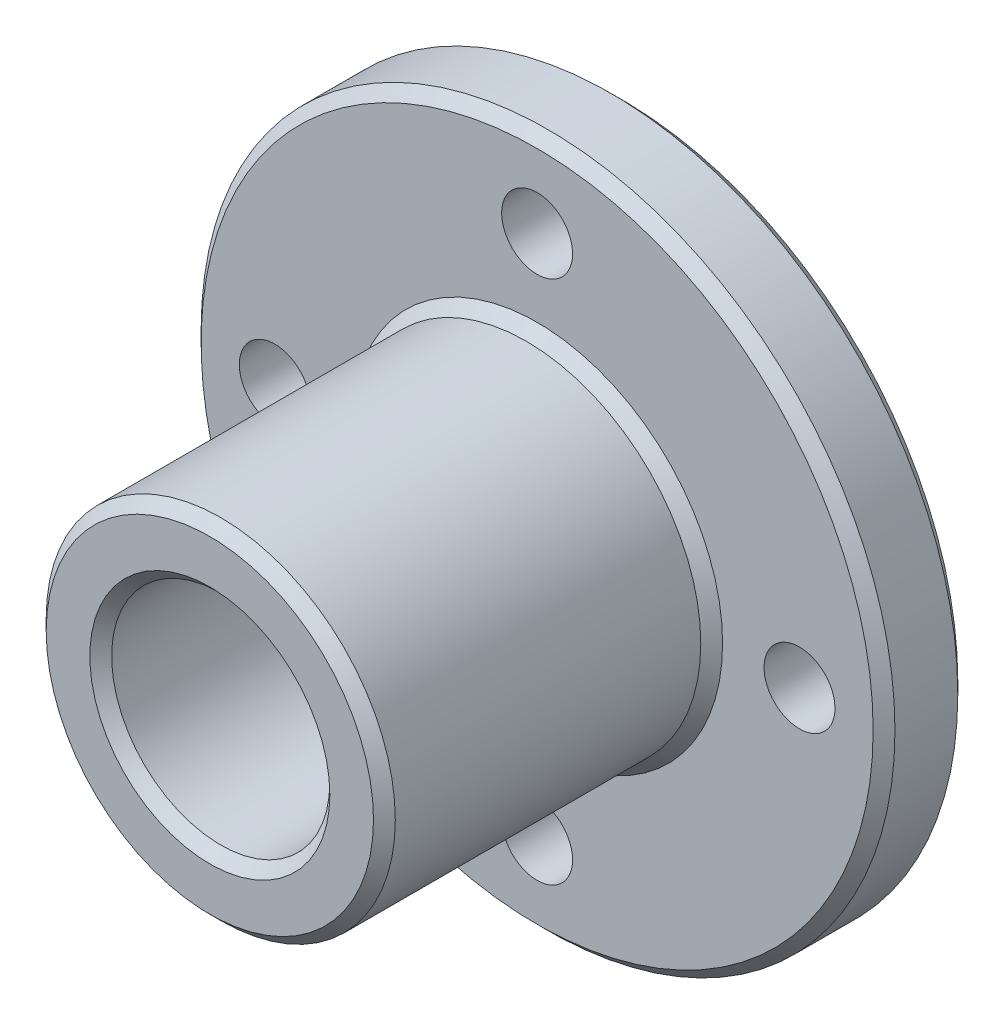
ISO-10303-21;
HEADER;
FILE_DESCRIPTION(('STEP AP214'),'2;1');
FILE_NAME('part.step','',(''),(''),'','','');
FILE_SCHEMA(('AUTOMOTIVE_DESIGN { 1 0 10303 214 1 1 1 1 }'));
ENDSEC;
DATA;
#1=APPLICATION_CONTEXT('core data for automotive mechanical design processes');
#2=APPLICATION_PROTOCOL_DEFINITION('international standard','automotive_design',2000,#1);
#3=PRODUCT_CONTEXT('',#1,'mechanical');
#4=PRODUCT('Part','Part','',(#3));
#5=PRODUCT_RELATED_PRODUCT_CATEGORY('part','',(#4));
#6=PRODUCT_DEFINITION_FORMATION('','',#4);
#7=PRODUCT_DEFINITION_CONTEXT('part definition',#1,'design');
#8=PRODUCT_DEFINITION('design','',#6,#7);
#9=PRODUCT_DEFINITION_SHAPE('','',#8);
#10=(LENGTH_UNIT() NAMED_UNIT(*) SI_UNIT(.MILLI.,.METRE.));
#11=(NAMED_UNIT(*) PLANE_ANGLE_UNIT() SI_UNIT($,.RADIAN.));
#12=(NAMED_UNIT(*) SI_UNIT($,.STERADIAN.) SOLID_ANGLE_UNIT());
#13=UNCERTAINTY_MEASURE_WITH_UNIT(LENGTH_MEASURE(1.E-05),#10,'distance_accuracy_value','');
#14=(GEOMETRIC_REPRESENTATION_CONTEXT(3) GLOBAL_UNCERTAINTY_ASSIGNED_CONTEXT((#13)) GLOBAL_UNIT_ASSIGNED_CONTEXT((#10,
#11,#12)) REPRESENTATION_CONTEXT('',''));
#15=CARTESIAN_POINT('',(0.,0.,0.));
#16=DIRECTION('',(0.,0.,1.));
#17=DIRECTION('',(1.,0.,0.));
#18=AXIS2_PLACEMENT_3D('',#15,#16,#17);
#19=CARTESIAN_POINT('',(0.,0.,3.88));
#20=DIRECTION('',(0.,0.,1.));
#21=DIRECTION('',(1.,0.,0.));
#22=AXIS2_PLACEMENT_3D('',#19,#20,#21);
#23=PLANE('',#22);
#24=CARTESIAN_POINT('',(0.,0.,3.88));
#25=DIRECTION('',(0.,0.,1.));
#26=DIRECTION('',(1.,0.,0.));
#27=AXIS2_PLACEMENT_3D('',#24,#25,#26);
#28=CIRCLE('',#27,15.4);
#29=CARTESIAN_POINT('',(15.4,0.,3.88));
#30=VERTEX_POINT('',#29);
#31=EDGE_CURVE('E53',#30,#30,#28,.T.);
#32=ORIENTED_EDGE('',*,*,#31,.T.);
#33=EDGE_LOOP('',(#32));
#34=FACE_BOUND('',#33,.T.);
#35=CARTESIAN_POINT('',(0.,0.,3.88));
#36=DIRECTION('',(0.,0.,1.));
#37=DIRECTION('',(1.,0.,0.));
#38=AXIS2_PLACEMENT_3D('',#35,#36,#37);
#39=CIRCLE('',#38,8.49999999999998);
#40=CARTESIAN_POINT('',(8.49999999999998,0.,3.88));
#41=VERTEX_POINT('',#40);
#42=EDGE_CURVE('E56',#41,#41,#39,.F.);
#43=ORIENTED_EDGE('',*,*,#42,.T.);
#44=EDGE_LOOP('',(#43));
#45=FACE_BOUND('',#44,.T.);
#46=CARTESIAN_POINT('',(-12.025,0.,3.88));
#47=DIRECTION('',(0.,0.,1.));
#48=DIRECTION('',(1.,0.,0.));
#49=AXIS2_PLACEMENT_3D('',#46,#47,#48);
#50=CIRCLE('',#49,1.625);
#51=CARTESIAN_POINT('',(-10.4,0.,3.88));
#52=VERTEX_POINT('',#51);
#53=EDGE_CURVE('E87',#52,#52,#50,.T.);
#54=ORIENTED_EDGE('',*,*,#53,.F.);
#55=EDGE_LOOP('',(#54));
#56=FACE_BOUND('',#55,.T.);
#57=CARTESIAN_POINT('',(12.025,0.,3.88));
#58=DIRECTION('',(0.,0.,1.));
#59=DIRECTION('',(1.,0.,0.));
#60=AXIS2_PLACEMENT_3D('',#57,#58,#59);
#61=CIRCLE('',#60,1.625);
#62=CARTESIAN_POINT('',(13.65,0.,3.88));
#63=VERTEX_POINT('',#62);
#64=EDGE_CURVE('E75',#63,#63,#61,.T.);
#65=ORIENTED_EDGE('',*,*,#64,.F.);
#66=EDGE_LOOP('',(#65));
#67=FACE_BOUND('',#66,.T.);
#68=CARTESIAN_POINT('',(0.,12.025,3.88));
#69=DIRECTION('',(0.,0.,1.));
#70=DIRECTION('',(1.,0.,0.));
#71=AXIS2_PLACEMENT_3D('',#68,#69,#70);
#72=CIRCLE('',#71,1.625);
#73=CARTESIAN_POINT('',(1.625,12.025,3.88));
#74=VERTEX_POINT('',#73);
#75=EDGE_CURVE('E71',#74,#74,#72,.T.);
#76=ORIENTED_EDGE('',*,*,#75,.F.);
#77=EDGE_LOOP('',(#76));
#78=FACE_BOUND('',#77,.T.);
#79=CARTESIAN_POINT('',(0.,-12.025,3.88));
#80=DIRECTION('',(0.,0.,1.));
#81=DIRECTION('',(1.,0.,0.));
#82=AXIS2_PLACEMENT_3D('',#79,#80,#81);
#83=CIRCLE('',#82,1.625);
#84=CARTESIAN_POINT('',(1.625,-12.025,3.88));
#85=VERTEX_POINT('',#84);
#86=EDGE_CURVE('E81',#85,#85,#83,.T.);
#87=ORIENTED_EDGE('',*,*,#86,.F.);
#88=EDGE_LOOP('',(#87));
#89=FACE_BOUND('',#88,.T.);
#90=ADVANCED_FACE('F30',(#34,#45,#56,#67,#78,#89),#23,.T.);
#91=CARTESIAN_POINT('',(0.,0.,0.));
#92=DIRECTION('',(0.,0.,1.));
#93=DIRECTION('',(1.,0.,0.));
#94=AXIS2_PLACEMENT_3D('',#91,#92,#93);
#95=PLANE('',#94);
#96=CARTESIAN_POINT('',(0.,0.,0.));
#97=DIRECTION('',(0.,0.,1.));
#98=DIRECTION('',(1.,0.,0.));
#99=AXIS2_PLACEMENT_3D('',#96,#97,#98);
#100=CIRCLE('',#99,15.4);
#101=CARTESIAN_POINT('',(15.4,0.,0.));
#102=VERTEX_POINT('',#101);
#103=EDGE_CURVE('E59',#102,#102,#100,.F.);
#104=ORIENTED_EDGE('',*,*,#103,.T.);
#105=EDGE_LOOP('',(#104));
#106=FACE_BOUND('',#105,.T.);
#107=CARTESIAN_POINT('',(0.,0.,0.));
#108=DIRECTION('',(0.,0.,1.));
#109=DIRECTION('',(1.,0.,0.));
#110=AXIS2_PLACEMENT_3D('',#107,#108,#109);
#111=CIRCLE('',#110,5.);
#112=CARTESIAN_POINT('',(5.,0.,0.));
#113=VERTEX_POINT('',#112);
#114=EDGE_CURVE('E68',#113,#113,#111,.T.);
#115=ORIENTED_EDGE('',*,*,#114,.T.);
#116=EDGE_LOOP('',(#115));
#117=FACE_BOUND('',#116,.T.);
#118=CARTESIAN_POINT('',(0.,12.025,0.));
#119=DIRECTION('',(0.,0.,1.));
#120=DIRECTION('',(1.,0.,0.));
#121=AXIS2_PLACEMENT_3D('',#118,#119,#120);
#122=CIRCLE('',#121,1.625);
#123=CARTESIAN_POINT('',(1.625,12.025,0.));
#124=VERTEX_POINT('',#123);
#125=EDGE_CURVE('E72',#124,#124,#122,.T.);
#126=ORIENTED_EDGE('',*,*,#125,.T.);
#127=EDGE_LOOP('',(#126));
#128=FACE_BOUND('',#127,.T.);
#129=CARTESIAN_POINT('',(12.025,0.,0.));
#130=DIRECTION('',(0.,0.,1.));
#131=DIRECTION('',(1.,0.,0.));
#132=AXIS2_PLACEMENT_3D('',#129,#130,#131);
#133=CIRCLE('',#132,1.625);
#134=CARTESIAN_POINT('',(13.65,0.,0.));
#135=VERTEX_POINT('',#134);
#136=EDGE_CURVE('E78',#135,#135,#133,.T.);
#137=ORIENTED_EDGE('',*,*,#136,.T.);
#138=EDGE_LOOP('',(#137));
#139=FACE_BOUND('',#138,.T.);
#140=CARTESIAN_POINT('',(0.,-12.025,0.));
#141=DIRECTION('',(0.,0.,1.));
#142=DIRECTION('',(1.,0.,0.));
#143=AXIS2_PLACEMENT_3D('',#140,#141,#142);
#144=CIRCLE('',#143,1.625);
#145=CARTESIAN_POINT('',(1.625,-12.025,0.));
#146=VERTEX_POINT('',#145);
#147=EDGE_CURVE('E84',#146,#146,#144,.T.);
#148=ORIENTED_EDGE('',*,*,#147,.T.);
#149=EDGE_LOOP('',(#148));
#150=FACE_BOUND('',#149,.T.);
#151=CARTESIAN_POINT('',(-12.025,0.,0.));
#152=DIRECTION('',(0.,0.,1.));
#153=DIRECTION('',(1.,0.,0.));
#154=AXIS2_PLACEMENT_3D('',#151,#152,#153);
#155=CIRCLE('',#154,1.625);
#156=CARTESIAN_POINT('',(-10.4,0.,0.));
#157=VERTEX_POINT('',#156);
#158=EDGE_CURVE('E90',#157,#157,#155,.T.);
#159=ORIENTED_EDGE('',*,*,#158,.T.);
#160=EDGE_LOOP('',(#159));
#161=FACE_BOUND('',#160,.T.);
#162=ADVANCED_FACE('F101',(#106,#117,#128,#139,#150,#161),#95,.F.);
#163=CARTESIAN_POINT('',(0.,0.,3.88));
#164=DIRECTION('',(0.,0.,-1.));
#165=DIRECTION('',(-1.,0.,0.));
#166=AXIS2_PLACEMENT_3D('',#163,#164,#165);
#167=CYLINDRICAL_SURFACE('',#166,15.9);
#168=CARTESIAN_POINT('',(0.,0.,0.5));
#169=DIRECTION('',(0.,0.,1.));
#170=DIRECTION('',(1.,0.,0.));
#171=AXIS2_PLACEMENT_3D('',#168,#169,#170);
#172=CIRCLE('',#171,15.9);
#173=CARTESIAN_POINT('',(15.9,0.,0.5));
#174=VERTEX_POINT('',#173);
#175=EDGE_CURVE('E62',#174,#174,#172,.T.);
#176=ORIENTED_EDGE('',*,*,#175,.T.);
#177=EDGE_LOOP('',(#176));
#178=FACE_BOUND('',#177,.T.);
#179=CARTESIAN_POINT('',(0.,0.,3.37999999999998));
#180=DIRECTION('',(0.,0.,1.));
#181=DIRECTION('',(1.,0.,0.));
#182=AXIS2_PLACEMENT_3D('',#179,#180,#181);
#183=CIRCLE('',#182,15.9);
#184=CARTESIAN_POINT('',(15.9,0.,3.37999999999998));
#185=VERTEX_POINT('',#184);
#186=EDGE_CURVE('E65',#185,#185,#183,.F.);
#187=ORIENTED_EDGE('',*,*,#186,.T.);
#188=EDGE_LOOP('',(#187));
#189=FACE_BOUND('',#188,.T.);
#190=ADVANCED_FACE('F119',(#178,#189),#167,.T.);
#191=CARTESIAN_POINT('',(0.,0.,3.88));
#192=DIRECTION('',(0.,0.,-1.));
#193=DIRECTION('',(-1.,0.,0.));
#194=AXIS2_PLACEMENT_3D('',#191,#192,#193);
#195=CYLINDRICAL_SURFACE('',#194,5.);
#196=CARTESIAN_POINT('',(0.,0.,18.38));
#197=DIRECTION('',(0.,0.,1.));
#198=DIRECTION('',(1.,0.,0.));
#199=AXIS2_PLACEMENT_3D('',#196,#197,#198);
#200=CIRCLE('',#199,5.);
#201=CARTESIAN_POINT('',(5.,0.,18.38));
#202=VERTEX_POINT('',#201);
#203=EDGE_CURVE('E10',#202,#202,#200,.T.);
#204=ORIENTED_EDGE('',*,*,#203,.T.);
#205=EDGE_LOOP('',(#204));
#206=FACE_BOUND('',#205,.T.);
#207=ORIENTED_EDGE('',*,*,#114,.F.);
#208=EDGE_LOOP('',(#207));
#209=FACE_BOUND('',#208,.T.);
#210=ADVANCED_FACE('F139',(#206,#209),#195,.F.);
#211=CARTESIAN_POINT('',(0.,12.025,3.88));
#212=DIRECTION('',(0.,0.,-1.));
#213=DIRECTION('',(-1.,0.,0.));
#214=AXIS2_PLACEMENT_3D('',#211,#212,#213);
#215=CYLINDRICAL_SURFACE('',#214,1.625);
#216=ORIENTED_EDGE('',*,*,#75,.T.);
#217=EDGE_LOOP('',(#216));
#218=FACE_BOUND('',#217,.T.);
#219=ORIENTED_EDGE('',*,*,#125,.F.);
#220=EDGE_LOOP('',(#219));
#221=FACE_BOUND('',#220,.T.);
#222=ADVANCED_FACE('F135',(#218,#221),#215,.F.);
#223=CARTESIAN_POINT('',(12.025,0.,3.88));
#224=DIRECTION('',(0.,0.,-1.));
#225=DIRECTION('',(-1.,0.,0.));
#226=AXIS2_PLACEMENT_3D('',#223,#224,#225);
#227=CYLINDRICAL_SURFACE('',#226,1.625);
#228=ORIENTED_EDGE('',*,*,#64,.T.);
#229=EDGE_LOOP('',(#228));
#230=FACE_BOUND('',#229,.T.);
#231=ORIENTED_EDGE('',*,*,#136,.F.);
#232=EDGE_LOOP('',(#231));
#233=FACE_BOUND('',#232,.T.);
#234=ADVANCED_FACE('F113',(#230,#233),#227,.F.);
#235=CARTESIAN_POINT('',(0.,-12.025,3.88));
#236=DIRECTION('',(0.,0.,-1.));
#237=DIRECTION('',(-1.,0.,0.));
#238=AXIS2_PLACEMENT_3D('',#235,#236,#237);
#239=CYLINDRICAL_SURFACE('',#238,1.625);
#240=ORIENTED_EDGE('',*,*,#86,.T.);
#241=EDGE_LOOP('',(#240));
#242=FACE_BOUND('',#241,.T.);
#243=ORIENTED_EDGE('',*,*,#147,.F.);
#244=EDGE_LOOP('',(#243));
#245=FACE_BOUND('',#244,.T.);
#246=ADVANCED_FACE('F110',(#242,#245),#239,.F.);
#247=CARTESIAN_POINT('',(-12.025,0.,3.88));
#248=DIRECTION('',(0.,0.,-1.));
#249=DIRECTION('',(-1.,0.,0.));
#250=AXIS2_PLACEMENT_3D('',#247,#248,#249);
#251=CYLINDRICAL_SURFACE('',#250,1.625);
#252=ORIENTED_EDGE('',*,*,#53,.T.);
#253=EDGE_LOOP('',(#252));
#254=FACE_BOUND('',#253,.T.);
#255=ORIENTED_EDGE('',*,*,#158,.F.);
#256=EDGE_LOOP('',(#255));
#257=FACE_BOUND('',#256,.T.);
#258=ADVANCED_FACE('F96',(#254,#257),#251,.F.);
#259=CARTESIAN_POINT('',(0.,0.,18.88));
#260=DIRECTION('',(0.,0.,1.));
#261=DIRECTION('',(1.,0.,0.));
#262=AXIS2_PLACEMENT_3D('',#259,#260,#261);
#263=PLANE('',#262);
#264=CARTESIAN_POINT('',(0.,0.,18.88));
#265=DIRECTION('',(0.,0.,1.));
#266=DIRECTION('',(1.,0.,0.));
#267=AXIS2_PLACEMENT_3D('',#264,#265,#266);
#268=CIRCLE('',#267,7.5);
#269=CARTESIAN_POINT('',(7.5,0.,18.88));
#270=VERTEX_POINT('',#269);
#271=EDGE_CURVE('E37',#270,#270,#268,.T.);
#272=ORIENTED_EDGE('',*,*,#271,.T.);
#273=EDGE_LOOP('',(#272));
#274=FACE_BOUND('',#273,.T.);
#275=CARTESIAN_POINT('',(0.,0.,18.88));
#276=DIRECTION('',(0.,0.,1.));
#277=DIRECTION('',(1.,0.,0.));
#278=AXIS2_PLACEMENT_3D('',#275,#276,#277);
#279=CIRCLE('',#278,5.5);
#280=CARTESIAN_POINT('',(5.5,0.,18.88));
#281=VERTEX_POINT('',#280);
#282=EDGE_CURVE('E41',#281,#281,#279,.F.);
#283=ORIENTED_EDGE('',*,*,#282,.T.);
#284=EDGE_LOOP('',(#283));
#285=FACE_BOUND('',#284,.T.);
#286=ADVANCED_FACE('F124',(#274,#285),#263,.T.);
#287=CARTESIAN_POINT('',(0.,0.,18.88));
#288=DIRECTION('',(0.,0.,-1.));
#289=DIRECTION('',(-1.,0.,0.));
#290=AXIS2_PLACEMENT_3D('',#287,#288,#289);
#291=CYLINDRICAL_SURFACE('',#290,8.);
#292=CARTESIAN_POINT('',(0.,0.,4.37999999999999));
#293=DIRECTION('',(0.,0.,1.));
#294=DIRECTION('',(1.,0.,0.));
#295=AXIS2_PLACEMENT_3D('',#292,#293,#294);
#296=CIRCLE('',#295,8.);
#297=CARTESIAN_POINT('',(8.,0.,4.37999999999999));
#298=VERTEX_POINT('',#297);
#299=EDGE_CURVE('E45',#298,#298,#296,.T.);
#300=ORIENTED_EDGE('',*,*,#299,.T.);
#301=EDGE_LOOP('',(#300));
#302=FACE_BOUND('',#301,.T.);
#303=CARTESIAN_POINT('',(0.,0.,18.38));
#304=DIRECTION('',(0.,0.,1.));
#305=DIRECTION('',(1.,0.,0.));
#306=AXIS2_PLACEMENT_3D('',#303,#304,#305);
#307=CIRCLE('',#306,8.);
#308=CARTESIAN_POINT('',(8.,0.,18.38));
#309=VERTEX_POINT('',#308);
#310=EDGE_CURVE('E50',#309,#309,#307,.F.);
#311=ORIENTED_EDGE('',*,*,#310,.T.);
#312=EDGE_LOOP('',(#311));
#313=FACE_BOUND('',#312,.T.);
#314=ADVANCED_FACE('F129',(#302,#313),#291,.T.);
#315=CARTESIAN_POINT('',(0.,0.,0.5));
#316=DIRECTION('',(0.,0.,1.));
#317=DIRECTION('',(1.,0.,0.));
#318=AXIS2_PLACEMENT_3D('',#315,#316,#317);
#319=CONICAL_SURFACE('',#318,15.9,0.785398163397452);
#320=ORIENTED_EDGE('',*,*,#103,.F.);
#321=EDGE_LOOP('',(#320));
#322=FACE_BOUND('',#321,.T.);
#323=ORIENTED_EDGE('',*,*,#175,.F.);
#324=EDGE_LOOP('',(#323));
#325=FACE_BOUND('',#324,.T.);
#326=ADVANCED_FACE('F146',(#322,#325),#319,.T.);
#327=CARTESIAN_POINT('',(0.,0.,3.88));
#328=DIRECTION('',(0.,0.,-1.));
#329=DIRECTION('',(-1.,0.,0.));
#330=AXIS2_PLACEMENT_3D('',#327,#328,#329);
#331=CONICAL_SURFACE('',#330,15.4,0.785398163397434);
#332=ORIENTED_EDGE('',*,*,#186,.F.);
#333=EDGE_LOOP('',(#332));
#334=FACE_BOUND('',#333,.T.);
#335=ORIENTED_EDGE('',*,*,#31,.F.);
#336=EDGE_LOOP('',(#335));
#337=FACE_BOUND('',#336,.T.);
#338=ADVANCED_FACE('F149',(#334,#337),#331,.T.);
#339=CARTESIAN_POINT('',(0.,0.,4.37999999999999));
#340=DIRECTION('',(0.,0.,-1.));
#341=DIRECTION('',(-1.,0.,0.));
#342=AXIS2_PLACEMENT_3D('',#339,#340,#341);
#343=CONICAL_SURFACE('',#342,8.,0.785398163397441);
#344=ORIENTED_EDGE('',*,*,#42,.F.);
#345=EDGE_LOOP('',(#344));
#346=FACE_BOUND('',#345,.T.);
#347=ORIENTED_EDGE('',*,*,#299,.F.);
#348=EDGE_LOOP('',(#347));
#349=FACE_BOUND('',#348,.T.);
#350=ADVANCED_FACE('F153',(#346,#349),#343,.T.);
#351=CARTESIAN_POINT('',(0.,0.,18.88));
#352=DIRECTION('',(0.,0.,-1.));
#353=DIRECTION('',(-1.,0.,0.));
#354=AXIS2_PLACEMENT_3D('',#351,#352,#353);
#355=CONICAL_SURFACE('',#354,7.5,0.785398163397448);
#356=ORIENTED_EDGE('',*,*,#310,.F.);
#357=EDGE_LOOP('',(#356));
#358=FACE_BOUND('',#357,.T.);
#359=ORIENTED_EDGE('',*,*,#271,.F.);
#360=EDGE_LOOP('',(#359));
#361=FACE_BOUND('',#360,.T.);
#362=ADVANCED_FACE('F156',(#358,#361),#355,.T.);
#363=CARTESIAN_POINT('',(0.,0.,18.38));
#364=DIRECTION('',(0.,0.,1.));
#365=DIRECTION('',(1.,0.,0.));
#366=AXIS2_PLACEMENT_3D('',#363,#364,#365);
#367=CONICAL_SURFACE('',#366,5.,0.785398163397453);
#368=ORIENTED_EDGE('',*,*,#282,.F.);
#369=EDGE_LOOP('',(#368));
#370=FACE_BOUND('',#369,.T.);
#371=ORIENTED_EDGE('',*,*,#203,.F.);
#372=EDGE_LOOP('',(#371));
#373=FACE_BOUND('',#372,.T.);
#374=ADVANCED_FACE('F32',(#370,#373),#367,.F.);
#375=CLOSED_SHELL('',(#90,#162,#190,#210,#222,#234,#246,#258,#286,#314,#326,#338,#350,#362,#374));
#376=MANIFOLD_SOLID_BREP('B2',#375);
#377=ADVANCED_BREP_SHAPE_REPRESENTATION('',(#18,#376),#14);
#378=SHAPE_DEFINITION_REPRESENTATION(#9,#377);
ENDSEC;
END-ISO-10303-21;
